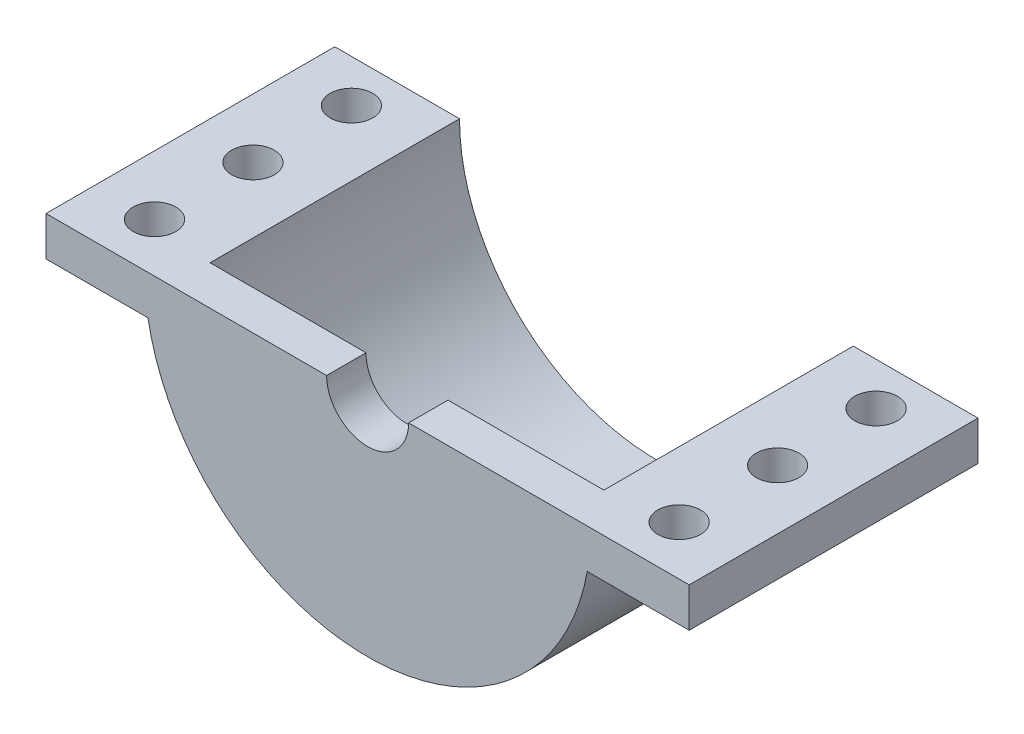
ISO-10303-21;
HEADER;
FILE_DESCRIPTION(('STEP AP214'),'2;1');
FILE_NAME('part.step','',(''),(''),'','','');
FILE_SCHEMA(('AUTOMOTIVE_DESIGN { 1 0 10303 214 1 1 1 1 }'));
ENDSEC;
DATA;
#1=APPLICATION_CONTEXT('core data for automotive mechanical design processes');
#2=APPLICATION_PROTOCOL_DEFINITION('international standard','automotive_design',2000,#1);
#3=PRODUCT_CONTEXT('',#1,'mechanical');
#4=PRODUCT('Part','Part','',(#3));
#5=PRODUCT_RELATED_PRODUCT_CATEGORY('part','',(#4));
#6=PRODUCT_DEFINITION_FORMATION('','',#4);
#7=PRODUCT_DEFINITION_CONTEXT('part definition',#1,'design');
#8=PRODUCT_DEFINITION('design','',#6,#7);
#9=PRODUCT_DEFINITION_SHAPE('','',#8);
#10=(LENGTH_UNIT() NAMED_UNIT(*) SI_UNIT(.MILLI.,.METRE.));
#11=(NAMED_UNIT(*) PLANE_ANGLE_UNIT() SI_UNIT($,.RADIAN.));
#12=(NAMED_UNIT(*) SI_UNIT($,.STERADIAN.) SOLID_ANGLE_UNIT());
#13=UNCERTAINTY_MEASURE_WITH_UNIT(LENGTH_MEASURE(1.E-05),#10,'distance_accuracy_value','');
#14=(GEOMETRIC_REPRESENTATION_CONTEXT(3) GLOBAL_UNCERTAINTY_ASSIGNED_CONTEXT((#13)) GLOBAL_UNIT_ASSIGNED_CONTEXT((#10,
#11,#12)) REPRESENTATION_CONTEXT('',''));
#15=CARTESIAN_POINT('',(0.,0.,0.));
#16=DIRECTION('',(0.,0.,1.));
#17=DIRECTION('',(1.,0.,0.));
#18=AXIS2_PLACEMENT_3D('',#15,#16,#17);
#19=CARTESIAN_POINT('',(0.,0.,19.));
#20=DIRECTION('',(0.,1.,0.));
#21=DIRECTION('',(0.,0.,1.));
#22=AXIS2_PLACEMENT_3D('',#19,#20,#21);
#23=PLANE('',#22);
#24=CARTESIAN_POINT('',(-19.9832005306815,0.,10.75));
#25=DIRECTION('',(0.,-1.,0.));
#26=DIRECTION('',(1.,0.,0.));
#27=AXIS2_PLACEMENT_3D('',#24,#25,#26);
#28=CIRCLE('',#27,1.625);
#29=CARTESIAN_POINT('',(-18.3582005306815,0.,10.75));
#30=VERTEX_POINT('',#29);
#31=EDGE_CURVE('E259',#30,#30,#28,.T.);
#32=ORIENTED_EDGE('',*,*,#31,.T.);
#33=EDGE_LOOP('',(#32));
#34=FACE_BOUND('',#33,.T.);
#35=CARTESIAN_POINT('',(-19.9832005306816,0.,18.25));
#36=DIRECTION('',(0.,-1.,0.));
#37=DIRECTION('',(1.,0.,0.));
#38=AXIS2_PLACEMENT_3D('',#35,#36,#37);
#39=CIRCLE('',#38,1.625);
#40=CARTESIAN_POINT('',(-18.3582005306816,0.,18.25));
#41=VERTEX_POINT('',#40);
#42=EDGE_CURVE('E260',#41,#41,#39,.T.);
#43=ORIENTED_EDGE('',*,*,#42,.T.);
#44=EDGE_LOOP('',(#43));
#45=FACE_BOUND('',#44,.T.);
#46=CARTESIAN_POINT('',(-19.9832005306815,0.,3.25));
#47=DIRECTION('',(0.,-1.,0.));
#48=DIRECTION('',(1.,0.,0.));
#49=AXIS2_PLACEMENT_3D('',#46,#47,#48);
#50=CIRCLE('',#49,1.625);
#51=CARTESIAN_POINT('',(-18.3582005306815,0.,3.25));
#52=VERTEX_POINT('',#51);
#53=EDGE_CURVE('E235',#52,#52,#50,.T.);
#54=ORIENTED_EDGE('',*,*,#53,.T.);
#55=EDGE_LOOP('',(#54));
#56=FACE_BOUND('',#55,.T.);
#57=DIRECTION('',(0.,0.,-1.));
#58=VECTOR('',#57,1.);
#59=CARTESIAN_POINT('',(-15.,0.,19.));
#60=LINE('',#59,#58);
#61=CARTESIAN_POINT('',(-15.,0.,19.));
#62=VERTEX_POINT('',#61);
#63=CARTESIAN_POINT('',(-15.,0.,0.));
#64=VERTEX_POINT('',#63);
#65=EDGE_CURVE('E161',#62,#64,#60,.T.);
#66=ORIENTED_EDGE('',*,*,#65,.T.);
#67=DIRECTION('',(1.,0.,0.));
#68=VECTOR('',#67,1.);
#69=CARTESIAN_POINT('',(0.,0.,0.));
#70=LINE('',#69,#68);
#71=CARTESIAN_POINT('',(-24.5,0.,0.));
#72=VERTEX_POINT('',#71);
#73=EDGE_CURVE('E148',#72,#64,#70,.T.);
#74=ORIENTED_EDGE('',*,*,#73,.F.);
#75=DIRECTION('',(0.,0.,1.));
#76=VECTOR('',#75,1.);
#77=CARTESIAN_POINT('',(-24.5,0.,0.));
#78=LINE('',#77,#76);
#79=CARTESIAN_POINT('',(-24.5,0.,22.));
#80=VERTEX_POINT('',#79);
#81=EDGE_CURVE('E208',#72,#80,#78,.T.);
#82=ORIENTED_EDGE('',*,*,#81,.T.);
#83=DIRECTION('',(1.,0.,0.));
#84=VECTOR('',#83,1.);
#85=CARTESIAN_POINT('',(0.,0.,22.));
#86=LINE('',#85,#84);
#87=CARTESIAN_POINT('',(-3.125,0.,22.));
#88=VERTEX_POINT('',#87);
#89=EDGE_CURVE('E65',#80,#88,#86,.T.);
#90=ORIENTED_EDGE('',*,*,#89,.T.);
#91=DIRECTION('',(0.,0.,1.));
#92=VECTOR('',#91,1.);
#93=CARTESIAN_POINT('',(-3.125,0.,19.));
#94=LINE('',#93,#92);
#95=CARTESIAN_POINT('',(-3.125,0.,19.));
#96=VERTEX_POINT('',#95);
#97=EDGE_CURVE('E185',#96,#88,#94,.T.);
#98=ORIENTED_EDGE('',*,*,#97,.F.);
#99=DIRECTION('',(1.,0.,0.));
#100=VECTOR('',#99,1.);
#101=CARTESIAN_POINT('',(0.,0.,19.));
#102=LINE('',#101,#100);
#103=EDGE_CURVE('E184',#62,#96,#102,.T.);
#104=ORIENTED_EDGE('',*,*,#103,.F.);
#105=EDGE_LOOP('',(#66,#74,#82,#90,#98,#104));
#106=FACE_BOUND('',#105,.T.);
#107=ADVANCED_FACE('F41',(#34,#45,#56,#106),#23,.T.);
#108=CARTESIAN_POINT('',(0.,0.,19.));
#109=DIRECTION('',(0.,0.,-1.));
#110=DIRECTION('',(-1.,0.,0.));
#111=AXIS2_PLACEMENT_3D('',#108,#109,#110);
#112=CYLINDRICAL_SURFACE('',#111,17.);
#113=CARTESIAN_POINT('',(0.,0.,0.));
#114=DIRECTION('',(0.,0.,1.));
#115=DIRECTION('',(1.,0.,0.));
#116=AXIS2_PLACEMENT_3D('',#113,#114,#115);
#117=CIRCLE('',#116,17.);
#118=CARTESIAN_POINT('',(-16.7332005306815,-3.,0.));
#119=VERTEX_POINT('',#118);
#120=CARTESIAN_POINT('',(16.7332005306815,-3.,0.));
#121=VERTEX_POINT('',#120);
#122=EDGE_CURVE('E139',#119,#121,#117,.T.);
#123=ORIENTED_EDGE('',*,*,#122,.T.);
#124=DIRECTION('',(0.,0.,1.));
#125=VECTOR('',#124,1.);
#126=CARTESIAN_POINT('',(16.7332005306815,-3.,0.));
#127=LINE('',#126,#125);
#128=CARTESIAN_POINT('',(16.7332005306815,-3.,22.));
#129=VERTEX_POINT('',#128);
#130=EDGE_CURVE('E121',#121,#129,#127,.T.);
#131=ORIENTED_EDGE('',*,*,#130,.T.);
#132=CARTESIAN_POINT('',(0.,0.,22.));
#133=DIRECTION('',(0.,0.,1.));
#134=DIRECTION('',(1.,0.,0.));
#135=AXIS2_PLACEMENT_3D('',#132,#133,#134);
#136=CIRCLE('',#135,17.);
#137=CARTESIAN_POINT('',(-16.7332005306815,-3.,22.));
#138=VERTEX_POINT('',#137);
#139=EDGE_CURVE('E154',#138,#129,#136,.T.);
#140=ORIENTED_EDGE('',*,*,#139,.F.);
#141=DIRECTION('',(0.,0.,1.));
#142=VECTOR('',#141,1.);
#143=CARTESIAN_POINT('',(-16.7332005306815,-3.,0.));
#144=LINE('',#143,#142);
#145=EDGE_CURVE('E145',#119,#138,#144,.T.);
#146=ORIENTED_EDGE('',*,*,#145,.F.);
#147=EDGE_LOOP('',(#123,#131,#140,#146));
#148=FACE_BOUND('',#147,.T.);
#149=ADVANCED_FACE('F43',(#148),#112,.T.);
#150=CARTESIAN_POINT('',(19.9832005306815,0.,3.25));
#151=DIRECTION('',(0.,-1.,0.));
#152=DIRECTION('',(-1.,0.,0.));
#153=AXIS2_PLACEMENT_3D('',#150,#151,#152);
#154=CIRCLE('',#153,1.625);
#155=CARTESIAN_POINT('',(18.3582005306815,0.,3.25));
#156=VERTEX_POINT('',#155);
#157=EDGE_CURVE('E250',#156,#156,#154,.T.);
#158=ORIENTED_EDGE('',*,*,#157,.T.);
#159=EDGE_LOOP('',(#158));
#160=FACE_BOUND('',#159,.T.);
#161=CARTESIAN_POINT('',(19.9832005306816,0.,18.25));
#162=DIRECTION('',(0.,-1.,0.));
#163=DIRECTION('',(-1.,0.,0.));
#164=AXIS2_PLACEMENT_3D('',#161,#162,#163);
#165=CIRCLE('',#164,1.625);
#166=CARTESIAN_POINT('',(18.3582005306816,0.,18.25));
#167=VERTEX_POINT('',#166);
#168=EDGE_CURVE('E242',#167,#167,#165,.T.);
#169=ORIENTED_EDGE('',*,*,#168,.T.);
#170=EDGE_LOOP('',(#169));
#171=FACE_BOUND('',#170,.T.);
#172=CARTESIAN_POINT('',(19.9832005306815,0.,10.75));
#173=DIRECTION('',(0.,-1.,0.));
#174=DIRECTION('',(-1.,0.,0.));
#175=AXIS2_PLACEMENT_3D('',#172,#173,#174);
#176=CIRCLE('',#175,1.625);
#177=CARTESIAN_POINT('',(18.3582005306815,0.,10.75));
#178=VERTEX_POINT('',#177);
#179=EDGE_CURVE('E274',#178,#178,#176,.T.);
#180=ORIENTED_EDGE('',*,*,#179,.T.);
#181=EDGE_LOOP('',(#180));
#182=FACE_BOUND('',#181,.T.);
#183=CARTESIAN_POINT('',(3.125,0.,22.));
#184=VERTEX_POINT('',#183);
#185=CARTESIAN_POINT('',(24.5,0.,22.));
#186=VERTEX_POINT('',#185);
#187=EDGE_CURVE('E189',#184,#186,#86,.T.);
#188=ORIENTED_EDGE('',*,*,#187,.T.);
#189=DIRECTION('',(0.,0.,1.));
#190=VECTOR('',#189,1.);
#191=CARTESIAN_POINT('',(24.5,0.,0.));
#192=LINE('',#191,#190);
#193=CARTESIAN_POINT('',(24.5,0.,0.));
#194=VERTEX_POINT('',#193);
#195=EDGE_CURVE('E177',#194,#186,#192,.T.);
#196=ORIENTED_EDGE('',*,*,#195,.F.);
#197=CARTESIAN_POINT('',(15.,0.,0.));
#198=VERTEX_POINT('',#197);
#199=EDGE_CURVE('E147',#198,#194,#70,.T.);
#200=ORIENTED_EDGE('',*,*,#199,.F.);
#201=DIRECTION('',(0.,0.,-1.));
#202=VECTOR('',#201,1.);
#203=CARTESIAN_POINT('',(15.,0.,19.));
#204=LINE('',#203,#202);
#205=CARTESIAN_POINT('',(15.,0.,19.));
#206=VERTEX_POINT('',#205);
#207=EDGE_CURVE('E50',#206,#198,#204,.T.);
#208=ORIENTED_EDGE('',*,*,#207,.F.);
#209=CARTESIAN_POINT('',(3.125,0.,19.));
#210=VERTEX_POINT('',#209);
#211=EDGE_CURVE('E190',#210,#206,#102,.T.);
#212=ORIENTED_EDGE('',*,*,#211,.F.);
#213=DIRECTION('',(0.,0.,1.));
#214=VECTOR('',#213,1.);
#215=CARTESIAN_POINT('',(3.125,0.,19.));
#216=LINE('',#215,#214);
#217=EDGE_CURVE('E202',#184,#210,#216,.F.);
#218=ORIENTED_EDGE('',*,*,#217,.F.);
#219=EDGE_LOOP('',(#188,#196,#200,#208,#212,#218));
#220=FACE_BOUND('',#219,.T.);
#221=ADVANCED_FACE('F175',(#160,#171,#182,#220),#23,.T.);
#222=CARTESIAN_POINT('',(0.,0.,19.));
#223=DIRECTION('',(0.,0.,-1.));
#224=DIRECTION('',(-1.,0.,0.));
#225=AXIS2_PLACEMENT_3D('',#222,#223,#224);
#226=CYLINDRICAL_SURFACE('',#225,15.);
#227=CARTESIAN_POINT('',(0.,0.,0.));
#228=DIRECTION('',(0.,0.,1.));
#229=DIRECTION('',(1.,0.,0.));
#230=AXIS2_PLACEMENT_3D('',#227,#228,#229);
#231=CIRCLE('',#230,15.);
#232=EDGE_CURVE('E152',#64,#198,#231,.T.);
#233=ORIENTED_EDGE('',*,*,#232,.F.);
#234=ORIENTED_EDGE('',*,*,#65,.F.);
#235=CARTESIAN_POINT('',(0.,0.,19.));
#236=DIRECTION('',(0.,0.,1.));
#237=DIRECTION('',(1.,0.,0.));
#238=AXIS2_PLACEMENT_3D('',#235,#236,#237);
#239=CIRCLE('',#238,15.);
#240=EDGE_CURVE('E160',#62,#206,#239,.T.);
#241=ORIENTED_EDGE('',*,*,#240,.T.);
#242=ORIENTED_EDGE('',*,*,#207,.T.);
#243=EDGE_LOOP('',(#233,#234,#241,#242));
#244=FACE_BOUND('',#243,.T.);
#245=ADVANCED_FACE('F170',(#244),#226,.F.);
#246=CARTESIAN_POINT('',(0.,0.,0.));
#247=DIRECTION('',(0.,0.,1.));
#248=DIRECTION('',(1.,0.,0.));
#249=AXIS2_PLACEMENT_3D('',#246,#247,#248);
#250=PLANE('',#249);
#251=ORIENTED_EDGE('',*,*,#199,.T.);
#252=DIRECTION('',(0.,1.,0.));
#253=VECTOR('',#252,1.);
#254=CARTESIAN_POINT('',(24.5,0.,0.));
#255=LINE('',#254,#253);
#256=CARTESIAN_POINT('',(24.5,-3.,0.));
#257=VERTEX_POINT('',#256);
#258=EDGE_CURVE('E133',#257,#194,#255,.T.);
#259=ORIENTED_EDGE('',*,*,#258,.F.);
#260=DIRECTION('',(1.,0.,0.));
#261=VECTOR('',#260,1.);
#262=CARTESIAN_POINT('',(16.7332005306815,-3.,0.));
#263=LINE('',#262,#261);
#264=EDGE_CURVE('E124',#121,#257,#263,.T.);
#265=ORIENTED_EDGE('',*,*,#264,.F.);
#266=ORIENTED_EDGE('',*,*,#122,.F.);
#267=DIRECTION('',(1.,0.,0.));
#268=VECTOR('',#267,1.);
#269=CARTESIAN_POINT('',(-16.7332005306815,-3.,0.));
#270=LINE('',#269,#268);
#271=CARTESIAN_POINT('',(-24.5,-3.,0.));
#272=VERTEX_POINT('',#271);
#273=EDGE_CURVE('E212',#272,#119,#270,.T.);
#274=ORIENTED_EDGE('',*,*,#273,.F.);
#275=DIRECTION('',(0.,-1.,0.));
#276=VECTOR('',#275,1.);
#277=CARTESIAN_POINT('',(-24.5,0.,0.));
#278=LINE('',#277,#276);
#279=EDGE_CURVE('E180',#72,#272,#278,.T.);
#280=ORIENTED_EDGE('',*,*,#279,.F.);
#281=ORIENTED_EDGE('',*,*,#73,.T.);
#282=ORIENTED_EDGE('',*,*,#232,.T.);
#283=EDGE_LOOP('',(#251,#259,#265,#266,#274,#280,#281,#282));
#284=FACE_BOUND('',#283,.T.);
#285=ADVANCED_FACE('F137',(#284),#250,.F.);
#286=CARTESIAN_POINT('',(0.,0.,19.));
#287=DIRECTION('',(0.,0.,1.));
#288=DIRECTION('',(1.,0.,0.));
#289=AXIS2_PLACEMENT_3D('',#286,#287,#288);
#290=PLANE('',#289);
#291=ORIENTED_EDGE('',*,*,#103,.T.);
#292=CARTESIAN_POINT('',(0.,0.,19.));
#293=DIRECTION('',(0.,0.,1.));
#294=DIRECTION('',(1.,0.,0.));
#295=AXIS2_PLACEMENT_3D('',#292,#293,#294);
#296=CIRCLE('',#295,3.125);
#297=EDGE_CURVE('E205',#96,#210,#296,.T.);
#298=ORIENTED_EDGE('',*,*,#297,.T.);
#299=ORIENTED_EDGE('',*,*,#211,.T.);
#300=ORIENTED_EDGE('',*,*,#240,.F.);
#301=EDGE_LOOP('',(#291,#298,#299,#300));
#302=FACE_BOUND('',#301,.T.);
#303=ADVANCED_FACE('F419',(#302),#290,.F.);
#304=CARTESIAN_POINT('',(0.,0.,22.));
#305=DIRECTION('',(0.,0.,1.));
#306=DIRECTION('',(1.,0.,0.));
#307=AXIS2_PLACEMENT_3D('',#304,#305,#306);
#308=PLANE('',#307);
#309=ORIENTED_EDGE('',*,*,#139,.T.);
#310=DIRECTION('',(1.,0.,0.));
#311=VECTOR('',#310,1.);
#312=CARTESIAN_POINT('',(16.7332005306815,-3.,22.));
#313=LINE('',#312,#311);
#314=CARTESIAN_POINT('',(24.5,-3.,22.));
#315=VERTEX_POINT('',#314);
#316=EDGE_CURVE('E127',#129,#315,#313,.T.);
#317=ORIENTED_EDGE('',*,*,#316,.T.);
#318=DIRECTION('',(0.,1.,0.));
#319=VECTOR('',#318,1.);
#320=CARTESIAN_POINT('',(24.5,0.,22.));
#321=LINE('',#320,#319);
#322=EDGE_CURVE('E142',#315,#186,#321,.T.);
#323=ORIENTED_EDGE('',*,*,#322,.T.);
#324=ORIENTED_EDGE('',*,*,#187,.F.);
#325=CARTESIAN_POINT('',(0.,0.,22.));
#326=DIRECTION('',(0.,0.,1.));
#327=DIRECTION('',(1.,0.,0.));
#328=AXIS2_PLACEMENT_3D('',#325,#326,#327);
#329=CIRCLE('',#328,3.125);
#330=EDGE_CURVE('E11',#88,#184,#329,.T.);
#331=ORIENTED_EDGE('',*,*,#330,.F.);
#332=ORIENTED_EDGE('',*,*,#89,.F.);
#333=DIRECTION('',(0.,-1.,0.));
#334=VECTOR('',#333,1.);
#335=CARTESIAN_POINT('',(-24.5,0.,22.));
#336=LINE('',#335,#334);
#337=CARTESIAN_POINT('',(-24.5,-3.,22.));
#338=VERTEX_POINT('',#337);
#339=EDGE_CURVE('E219',#80,#338,#336,.T.);
#340=ORIENTED_EDGE('',*,*,#339,.T.);
#341=DIRECTION('',(1.,0.,0.));
#342=VECTOR('',#341,1.);
#343=CARTESIAN_POINT('',(-16.7332005306815,-3.,22.));
#344=LINE('',#343,#342);
#345=EDGE_CURVE('E57',#338,#138,#344,.T.);
#346=ORIENTED_EDGE('',*,*,#345,.T.);
#347=EDGE_LOOP('',(#309,#317,#323,#324,#331,#332,#340,#346));
#348=FACE_BOUND('',#347,.T.);
#349=ADVANCED_FACE('F305',(#348),#308,.T.);
#350=CARTESIAN_POINT('',(0.,0.,19.));
#351=DIRECTION('',(0.,0.,1.));
#352=DIRECTION('',(1.,0.,0.));
#353=AXIS2_PLACEMENT_3D('',#350,#351,#352);
#354=CYLINDRICAL_SURFACE('',#353,3.125);
#355=ORIENTED_EDGE('',*,*,#97,.T.);
#356=ORIENTED_EDGE('',*,*,#330,.T.);
#357=ORIENTED_EDGE('',*,*,#217,.T.);
#358=ORIENTED_EDGE('',*,*,#297,.F.);
#359=EDGE_LOOP('',(#355,#356,#357,#358));
#360=FACE_BOUND('',#359,.T.);
#361=ADVANCED_FACE('F300',(#360),#354,.F.);
#362=CARTESIAN_POINT('',(-16.7332005306815,-3.,0.));
#363=DIRECTION('',(0.,-1.,0.));
#364=DIRECTION('',(1.,0.,0.));
#365=AXIS2_PLACEMENT_3D('',#362,#363,#364);
#366=PLANE('',#365);
#367=CARTESIAN_POINT('',(-19.9832005306815,-3.,10.75));
#368=DIRECTION('',(0.,-1.,0.));
#369=DIRECTION('',(1.,0.,0.));
#370=AXIS2_PLACEMENT_3D('',#367,#368,#369);
#371=CIRCLE('',#370,1.625);
#372=CARTESIAN_POINT('',(-18.3582005306815,-3.,10.75));
#373=VERTEX_POINT('',#372);
#374=EDGE_CURVE('E255',#373,#373,#371,.T.);
#375=ORIENTED_EDGE('',*,*,#374,.F.);
#376=EDGE_LOOP('',(#375));
#377=FACE_BOUND('',#376,.T.);
#378=CARTESIAN_POINT('',(-19.9832005306816,-3.,18.25));
#379=DIRECTION('',(0.,-1.,0.));
#380=DIRECTION('',(1.,0.,0.));
#381=AXIS2_PLACEMENT_3D('',#378,#379,#380);
#382=CIRCLE('',#381,1.625);
#383=CARTESIAN_POINT('',(-18.3582005306816,-3.,18.25));
#384=VERTEX_POINT('',#383);
#385=EDGE_CURVE('E278',#384,#384,#382,.T.);
#386=ORIENTED_EDGE('',*,*,#385,.F.);
#387=EDGE_LOOP('',(#386));
#388=FACE_BOUND('',#387,.T.);
#389=CARTESIAN_POINT('',(-19.9832005306815,-3.,3.25));
#390=DIRECTION('',(0.,-1.,0.));
#391=DIRECTION('',(1.,0.,0.));
#392=AXIS2_PLACEMENT_3D('',#389,#390,#391);
#393=CIRCLE('',#392,1.625);
#394=CARTESIAN_POINT('',(-18.3582005306815,-3.,3.25));
#395=VERTEX_POINT('',#394);
#396=EDGE_CURVE('E238',#395,#395,#393,.T.);
#397=ORIENTED_EDGE('',*,*,#396,.F.);
#398=EDGE_LOOP('',(#397));
#399=FACE_BOUND('',#398,.T.);
#400=ORIENTED_EDGE('',*,*,#345,.F.);
#401=DIRECTION('',(0.,0.,1.));
#402=VECTOR('',#401,1.);
#403=CARTESIAN_POINT('',(-24.5,-3.,0.));
#404=LINE('',#403,#402);
#405=EDGE_CURVE('E211',#272,#338,#404,.T.);
#406=ORIENTED_EDGE('',*,*,#405,.F.);
#407=ORIENTED_EDGE('',*,*,#273,.T.);
#408=ORIENTED_EDGE('',*,*,#145,.T.);
#409=EDGE_LOOP('',(#400,#406,#407,#408));
#410=FACE_BOUND('',#409,.T.);
#411=ADVANCED_FACE('F296',(#377,#388,#399,#410),#366,.T.);
#412=CARTESIAN_POINT('',(-24.5,0.,0.));
#413=DIRECTION('',(-1.,0.,0.));
#414=DIRECTION('',(0.,0.,1.));
#415=AXIS2_PLACEMENT_3D('',#412,#413,#414);
#416=PLANE('',#415);
#417=ORIENTED_EDGE('',*,*,#339,.F.);
#418=ORIENTED_EDGE('',*,*,#81,.F.);
#419=ORIENTED_EDGE('',*,*,#279,.T.);
#420=ORIENTED_EDGE('',*,*,#405,.T.);
#421=EDGE_LOOP('',(#417,#418,#419,#420));
#422=FACE_BOUND('',#421,.T.);
#423=ADVANCED_FACE('F299',(#422),#416,.T.);
#424=CARTESIAN_POINT('',(24.5,0.,0.));
#425=DIRECTION('',(1.,0.,0.));
#426=DIRECTION('',(0.,0.,-1.));
#427=AXIS2_PLACEMENT_3D('',#424,#425,#426);
#428=PLANE('',#427);
#429=ORIENTED_EDGE('',*,*,#322,.F.);
#430=DIRECTION('',(0.,0.,1.));
#431=VECTOR('',#430,1.);
#432=CARTESIAN_POINT('',(24.5,-3.,0.));
#433=LINE('',#432,#431);
#434=EDGE_CURVE('E132',#257,#315,#433,.T.);
#435=ORIENTED_EDGE('',*,*,#434,.F.);
#436=ORIENTED_EDGE('',*,*,#258,.T.);
#437=ORIENTED_EDGE('',*,*,#195,.T.);
#438=EDGE_LOOP('',(#429,#435,#436,#437));
#439=FACE_BOUND('',#438,.T.);
#440=ADVANCED_FACE('F309',(#439),#428,.T.);
#441=CARTESIAN_POINT('',(16.7332005306815,-3.,0.));
#442=DIRECTION('',(0.,-1.,0.));
#443=DIRECTION('',(1.,0.,0.));
#444=AXIS2_PLACEMENT_3D('',#441,#442,#443);
#445=PLANE('',#444);
#446=CARTESIAN_POINT('',(19.9832005306815,-2.99999999999999,3.25));
#447=DIRECTION('',(0.,-1.,0.));
#448=DIRECTION('',(-1.,0.,0.));
#449=AXIS2_PLACEMENT_3D('',#446,#447,#448);
#450=CIRCLE('',#449,1.625);
#451=CARTESIAN_POINT('',(18.3582005306815,-2.99999999999999,3.25));
#452=VERTEX_POINT('',#451);
#453=EDGE_CURVE('E246',#452,#452,#450,.T.);
#454=ORIENTED_EDGE('',*,*,#453,.F.);
#455=EDGE_LOOP('',(#454));
#456=FACE_BOUND('',#455,.T.);
#457=CARTESIAN_POINT('',(19.9832005306816,-2.99999999999999,18.25));
#458=DIRECTION('',(0.,-1.,0.));
#459=DIRECTION('',(-1.,0.,0.));
#460=AXIS2_PLACEMENT_3D('',#457,#458,#459);
#461=CIRCLE('',#460,1.625);
#462=CARTESIAN_POINT('',(18.3582005306816,-2.99999999999999,18.25));
#463=VERTEX_POINT('',#462);
#464=EDGE_CURVE('E264',#463,#463,#461,.T.);
#465=ORIENTED_EDGE('',*,*,#464,.F.);
#466=EDGE_LOOP('',(#465));
#467=FACE_BOUND('',#466,.T.);
#468=CARTESIAN_POINT('',(19.9832005306815,-2.99999999999999,10.75));
#469=DIRECTION('',(0.,-1.,0.));
#470=DIRECTION('',(-1.,0.,0.));
#471=AXIS2_PLACEMENT_3D('',#468,#469,#470);
#472=CIRCLE('',#471,1.625);
#473=CARTESIAN_POINT('',(18.3582005306815,-2.99999999999999,10.75));
#474=VERTEX_POINT('',#473);
#475=EDGE_CURVE('E254',#474,#474,#472,.T.);
#476=ORIENTED_EDGE('',*,*,#475,.F.);
#477=EDGE_LOOP('',(#476));
#478=FACE_BOUND('',#477,.T.);
#479=ORIENTED_EDGE('',*,*,#316,.F.);
#480=ORIENTED_EDGE('',*,*,#130,.F.);
#481=ORIENTED_EDGE('',*,*,#264,.T.);
#482=ORIENTED_EDGE('',*,*,#434,.T.);
#483=EDGE_LOOP('',(#479,#480,#481,#482));
#484=FACE_BOUND('',#483,.T.);
#485=ADVANCED_FACE('F123',(#456,#467,#478,#484),#445,.T.);
#486=CARTESIAN_POINT('',(19.9832005306815,0.,10.75));
#487=DIRECTION('',(0.,-1.,0.));
#488=DIRECTION('',(1.,0.,0.));
#489=AXIS2_PLACEMENT_3D('',#486,#487,#488);
#490=CYLINDRICAL_SURFACE('',#489,1.625);
#491=ORIENTED_EDGE('',*,*,#179,.F.);
#492=EDGE_LOOP('',(#491));
#493=FACE_BOUND('',#492,.T.);
#494=ORIENTED_EDGE('',*,*,#475,.T.);
#495=EDGE_LOOP('',(#494));
#496=FACE_BOUND('',#495,.T.);
#497=ADVANCED_FACE('F316',(#493,#496),#490,.F.);
#498=CARTESIAN_POINT('',(19.9832005306816,0.,18.25));
#499=DIRECTION('',(0.,-1.,0.));
#500=DIRECTION('',(1.,0.,0.));
#501=AXIS2_PLACEMENT_3D('',#498,#499,#500);
#502=CYLINDRICAL_SURFACE('',#501,1.625);
#503=ORIENTED_EDGE('',*,*,#168,.F.);
#504=EDGE_LOOP('',(#503));
#505=FACE_BOUND('',#504,.T.);
#506=ORIENTED_EDGE('',*,*,#464,.T.);
#507=EDGE_LOOP('',(#506));
#508=FACE_BOUND('',#507,.T.);
#509=ADVANCED_FACE('F341',(#505,#508),#502,.F.);
#510=CARTESIAN_POINT('',(19.9832005306815,0.,3.25));
#511=DIRECTION('',(0.,-1.,0.));
#512=DIRECTION('',(1.,0.,0.));
#513=AXIS2_PLACEMENT_3D('',#510,#511,#512);
#514=CYLINDRICAL_SURFACE('',#513,1.625);
#515=ORIENTED_EDGE('',*,*,#157,.F.);
#516=EDGE_LOOP('',(#515));
#517=FACE_BOUND('',#516,.T.);
#518=ORIENTED_EDGE('',*,*,#453,.T.);
#519=EDGE_LOOP('',(#518));
#520=FACE_BOUND('',#519,.T.);
#521=ADVANCED_FACE('F348',(#517,#520),#514,.F.);
#522=CARTESIAN_POINT('',(-19.9832005306815,0.,3.25));
#523=DIRECTION('',(0.,-1.,0.));
#524=DIRECTION('',(1.,0.,0.));
#525=AXIS2_PLACEMENT_3D('',#522,#523,#524);
#526=CYLINDRICAL_SURFACE('',#525,1.625);
#527=ORIENTED_EDGE('',*,*,#53,.F.);
#528=EDGE_LOOP('',(#527));
#529=FACE_BOUND('',#528,.T.);
#530=ORIENTED_EDGE('',*,*,#396,.T.);
#531=EDGE_LOOP('',(#530));
#532=FACE_BOUND('',#531,.T.);
#533=ADVANCED_FACE('F292',(#529,#532),#526,.F.);
#534=CARTESIAN_POINT('',(-19.9832005306816,0.,18.25));
#535=DIRECTION('',(0.,-1.,0.));
#536=DIRECTION('',(1.,0.,0.));
#537=AXIS2_PLACEMENT_3D('',#534,#535,#536);
#538=CYLINDRICAL_SURFACE('',#537,1.625);
#539=ORIENTED_EDGE('',*,*,#42,.F.);
#540=EDGE_LOOP('',(#539));
#541=FACE_BOUND('',#540,.T.);
#542=ORIENTED_EDGE('',*,*,#385,.T.);
#543=EDGE_LOOP('',(#542));
#544=FACE_BOUND('',#543,.T.);
#545=ADVANCED_FACE('F288',(#541,#544),#538,.F.);
#546=CARTESIAN_POINT('',(-19.9832005306815,0.,10.75));
#547=DIRECTION('',(0.,-1.,0.));
#548=DIRECTION('',(1.,0.,0.));
#549=AXIS2_PLACEMENT_3D('',#546,#547,#548);
#550=CYLINDRICAL_SURFACE('',#549,1.625);
#551=ORIENTED_EDGE('',*,*,#31,.F.);
#552=EDGE_LOOP('',(#551));
#553=FACE_BOUND('',#552,.T.);
#554=ORIENTED_EDGE('',*,*,#374,.T.);
#555=EDGE_LOOP('',(#554));
#556=FACE_BOUND('',#555,.T.);
#557=ADVANCED_FACE('F291',(#553,#556),#550,.F.);
#558=CLOSED_SHELL('',(#107,#149,#221,#245,#285,#303,#349,#361,#411,#423,#440,#485,#497,#509,
#521,#533,#545,#557));
#559=MANIFOLD_SOLID_BREP('B2',#558);
#560=ADVANCED_BREP_SHAPE_REPRESENTATION('',(#18,#559),#14);
#561=SHAPE_DEFINITION_REPRESENTATION(#9,#560);
ENDSEC;
END-ISO-10303-21;
